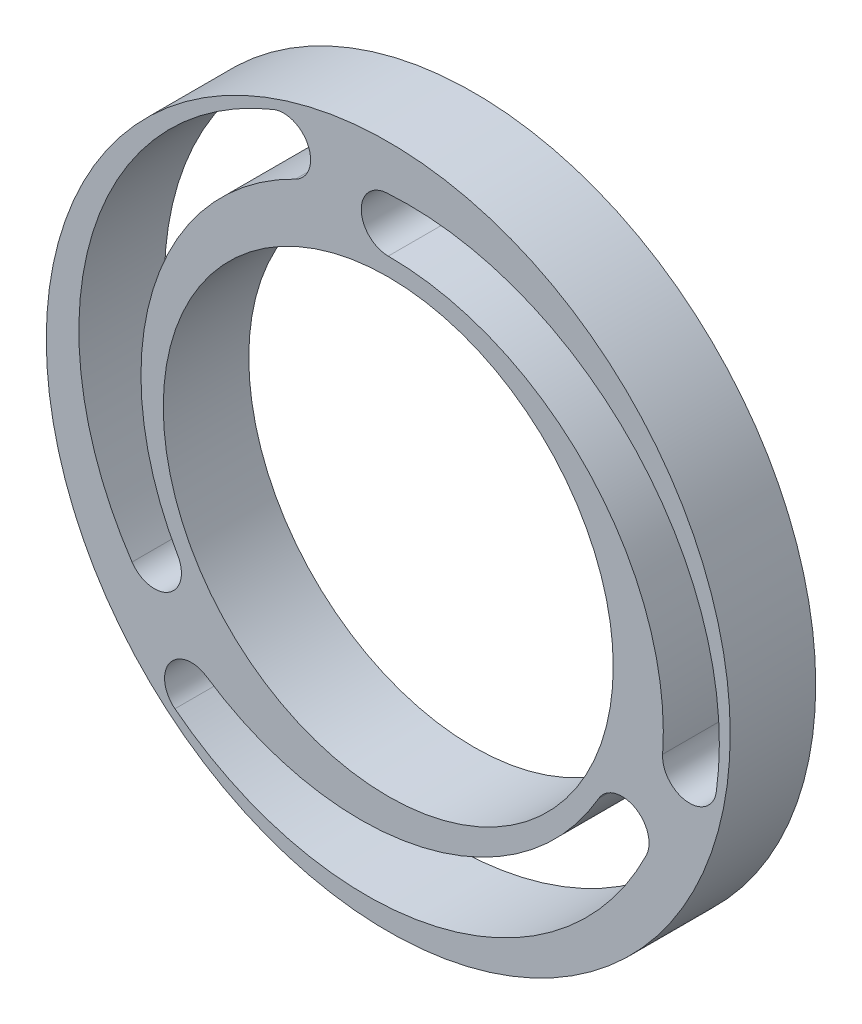
ISO-10303-21;
HEADER;
FILE_DESCRIPTION(('STEP AP214'),'2;1');
FILE_NAME('part.step','',(''),(''),'','','');
FILE_SCHEMA(('AUTOMOTIVE_DESIGN { 1 0 10303 214 1 1 1 1 }'));
ENDSEC;
DATA;
#1=APPLICATION_CONTEXT('core data for automotive mechanical design processes');
#2=APPLICATION_PROTOCOL_DEFINITION('international standard','automotive_design',2000,#1);
#3=PRODUCT_CONTEXT('',#1,'mechanical');
#4=PRODUCT('Part','Part','',(#3));
#5=PRODUCT_RELATED_PRODUCT_CATEGORY('part','',(#4));
#6=PRODUCT_DEFINITION_FORMATION('','',#4);
#7=PRODUCT_DEFINITION_CONTEXT('part definition',#1,'design');
#8=PRODUCT_DEFINITION('design','',#6,#7);
#9=PRODUCT_DEFINITION_SHAPE('','',#8);
#10=(LENGTH_UNIT() NAMED_UNIT(*) SI_UNIT(.MILLI.,.METRE.));
#11=(NAMED_UNIT(*) PLANE_ANGLE_UNIT() SI_UNIT($,.RADIAN.));
#12=(NAMED_UNIT(*) SI_UNIT($,.STERADIAN.) SOLID_ANGLE_UNIT());
#13=UNCERTAINTY_MEASURE_WITH_UNIT(LENGTH_MEASURE(1.E-05),#10,'distance_accuracy_value','');
#14=(GEOMETRIC_REPRESENTATION_CONTEXT(3) GLOBAL_UNCERTAINTY_ASSIGNED_CONTEXT((#13)) GLOBAL_UNIT_ASSIGNED_CONTEXT((#10,
#11,#12)) REPRESENTATION_CONTEXT('',''));
#15=CARTESIAN_POINT('',(0.,0.,0.));
#16=DIRECTION('',(0.,0.,1.));
#17=DIRECTION('',(1.,0.,0.));
#18=AXIS2_PLACEMENT_3D('',#15,#16,#17);
#19=CARTESIAN_POINT('',(0.,0.,9.5));
#20=DIRECTION('',(0.,0.,1.));
#21=DIRECTION('',(1.,0.,0.));
#22=AXIS2_PLACEMENT_3D('',#19,#20,#21);
#23=PLANE('',#22);
#24=CARTESIAN_POINT('',(-2.41247336985835,-1.14055669388795,9.5));
#25=DIRECTION('',(0.,0.,1.));
#26=DIRECTION('',(-0.500000000000004,-0.866025403784436,0.));
#27=AXIS2_PLACEMENT_3D('',#24,#25,#26);
#28=CIRCLE('',#27,34.5952526492614);
#29=CARTESIAN_POINT('',(28.6767274661686,-16.3159676353882,9.5));
#30=VERTEX_POINT('',#29);
#31=CARTESIAN_POINT('',(-23.70084455214,-28.4102607309989,9.5));
#32=VERTEX_POINT('',#31);
#33=EDGE_CURVE('E161',#30,#32,#28,.F.);
#34=ORIENTED_EDGE('',*,*,#33,.T.);
#35=CARTESIAN_POINT('',(-21.8547787293426,-26.0455110660451,9.5));
#36=DIRECTION('',(0.,0.,1.));
#37=DIRECTION('',(-0.500000000000004,-0.866025403784436,0.));
#38=AXIS2_PLACEMENT_3D('',#35,#36,#37);
#39=CIRCLE('',#38,3.);
#40=CARTESIAN_POINT('',(-20.1773783449244,-23.5582780752793,9.5));
#41=VERTEX_POINT('',#40);
#42=EDGE_CURVE('E168',#41,#32,#39,.T.);
#43=ORIENTED_EDGE('',*,*,#42,.F.);
#44=CARTESIAN_POINT('',(-3.08743132343008,1.78252930568686,9.5));
#45=DIRECTION('',(0.,0.,1.));
#46=DIRECTION('',(-0.500000000000004,-0.866025403784436,0.));
#47=AXIS2_PLACEMENT_3D('',#44,#45,#46);
#48=CIRCLE('',#47,30.5650586113737);
#49=CARTESIAN_POINT('',(23.3826859021798,-13.5000000000001,9.5));
#50=VERTEX_POINT('',#49);
#51=EDGE_CURVE('E55',#41,#50,#48,.T.);
#52=ORIENTED_EDGE('',*,*,#51,.T.);
#53=CARTESIAN_POINT('',(25.9807621135331,-15.0000000000001,9.5));
#54=DIRECTION('',(0.,0.,1.));
#55=DIRECTION('',(-0.500000000000004,-0.866025403784436,0.));
#56=AXIS2_PLACEMENT_3D('',#53,#54,#55);
#57=CIRCLE('',#56,3.);
#58=EDGE_CURVE('E164',#30,#50,#57,.T.);
#59=ORIENTED_EDGE('',*,*,#58,.F.);
#60=EDGE_LOOP('',(#34,#43,#52,#59));
#61=FACE_BOUND('',#60,.T.);
#62=CARTESIAN_POINT('',(0.,0.,9.5));
#63=DIRECTION('',(0.,0.,1.));
#64=DIRECTION('',(1.,0.,0.));
#65=AXIS2_PLACEMENT_3D('',#62,#63,#64);
#66=CIRCLE('',#65,25.);
#67=CARTESIAN_POINT('',(25.,0.,9.5));
#68=VERTEX_POINT('',#67);
#69=EDGE_CURVE('E219',#68,#68,#66,.T.);
#70=ORIENTED_EDGE('',*,*,#69,.F.);
#71=EDGE_LOOP('',(#70));
#72=FACE_BOUND('',#71,.T.);
#73=CARTESIAN_POINT('',(0.,0.,9.5));
#74=DIRECTION('',(0.,0.,1.));
#75=DIRECTION('',(1.,0.,0.));
#76=AXIS2_PLACEMENT_3D('',#73,#74,#75);
#77=CIRCLE('',#76,38.);
#78=CARTESIAN_POINT('',(38.,0.,9.5));
#79=VERTEX_POINT('',#78);
#80=EDGE_CURVE('E11',#79,#79,#77,.T.);
#81=ORIENTED_EDGE('',*,*,#80,.T.);
#82=EDGE_LOOP('',(#81));
#83=FACE_BOUND('',#82,.T.);
#84=CARTESIAN_POINT('',(2.19398775629254,-1.5189848773068,9.5));
#85=DIRECTION('',(0.,0.,1.));
#86=DIRECTION('',(1.,0.,0.));
#87=AXIS2_PLACEMENT_3D('',#84,#85,#86);
#88=CIRCLE('',#87,34.5952526492614);
#89=CARTESIAN_POINT('',(-0.208321273513586,32.9927583007991,9.5));
#90=VERTEX_POINT('',#89);
#91=CARTESIAN_POINT('',(36.4544297972545,-6.32040310779967,9.5));
#92=VERTEX_POINT('',#91);
#93=EDGE_CURVE('E189',#90,#92,#88,.F.);
#94=ORIENTED_EDGE('',*,*,#93,.T.);
#95=CARTESIAN_POINT('',(33.4834636024151,-5.90403804067576,9.5));
#96=DIRECTION('',(0.,0.,1.));
#97=DIRECTION('',(1.,0.,0.));
#98=AXIS2_PLACEMENT_3D('',#95,#96,#97);
#99=CIRCLE('',#98,3.);
#100=CARTESIAN_POINT('',(30.490756455072,-5.69498319083472,9.5));
#101=VERTEX_POINT('',#100);
#102=EDGE_CURVE('E198',#101,#92,#99,.T.);
#103=ORIENTED_EDGE('',*,*,#102,.F.);
#104=CARTESIAN_POINT('',(0.,-3.56505861137369,9.5));
#105=DIRECTION('',(0.,0.,1.));
#106=DIRECTION('',(1.,0.,0.));
#107=AXIS2_PLACEMENT_3D('',#104,#105,#106);
#108=CIRCLE('',#107,30.5650586113737);
#109=CARTESIAN_POINT('',(0.,27.,9.5));
#110=VERTEX_POINT('',#109);
#111=EDGE_CURVE('E195',#101,#110,#108,.T.);
#112=ORIENTED_EDGE('',*,*,#111,.T.);
#113=CARTESIAN_POINT('',(0.,30.,9.5));
#114=DIRECTION('',(0.,0.,1.));
#115=DIRECTION('',(1.,0.,0.));
#116=AXIS2_PLACEMENT_3D('',#113,#114,#115);
#117=CIRCLE('',#116,3.);
#118=EDGE_CURVE('E192',#90,#110,#117,.T.);
#119=ORIENTED_EDGE('',*,*,#118,.F.);
#120=EDGE_LOOP('',(#94,#103,#112,#119));
#121=FACE_BOUND('',#120,.T.);
#122=CARTESIAN_POINT('',(0.218485613565833,2.65954157119476,9.5));
#123=DIRECTION('',(0.,0.,1.));
#124=DIRECTION('',(-0.499999999999992,0.866025403784443,0.));
#125=AXIS2_PLACEMENT_3D('',#122,#123,#124);
#126=CIRCLE('',#125,34.5952526492614);
#127=CARTESIAN_POINT('',(-28.4684061926553,-16.6767906654108,9.5));
#128=VERTEX_POINT('',#127);
#129=CARTESIAN_POINT('',(-12.7535852451143,34.7306638387988,9.5));
#130=VERTEX_POINT('',#129);
#131=EDGE_CURVE('E136',#128,#130,#126,.F.);
#132=ORIENTED_EDGE('',*,*,#131,.T.);
#133=CARTESIAN_POINT('',(-11.6286848730723,31.949549106721,9.5));
#134=DIRECTION('',(0.,0.,1.));
#135=DIRECTION('',(-0.499999999999992,0.866025403784443,0.));
#136=AXIS2_PLACEMENT_3D('',#133,#134,#135);
#137=CIRCLE('',#136,3.);
#138=CARTESIAN_POINT('',(-10.3133781101475,29.2532612661142,9.5));
#139=VERTEX_POINT('',#138);
#140=EDGE_CURVE('E145',#139,#130,#137,.T.);
#141=ORIENTED_EDGE('',*,*,#140,.F.);
#142=CARTESIAN_POINT('',(3.08743132343011,1.78252930568682,9.5));
#143=DIRECTION('',(0.,0.,1.));
#144=DIRECTION('',(-0.499999999999992,0.866025403784443,0.));
#145=AXIS2_PLACEMENT_3D('',#142,#143,#144);
#146=CIRCLE('',#145,30.5650586113737);
#147=CARTESIAN_POINT('',(-23.38268590218,-13.4999999999998,9.5));
#148=VERTEX_POINT('',#147);
#149=EDGE_CURVE('E47',#139,#148,#146,.T.);
#150=ORIENTED_EDGE('',*,*,#149,.T.);
#151=CARTESIAN_POINT('',(-25.9807621135333,-14.9999999999998,9.5));
#152=DIRECTION('',(0.,0.,1.));
#153=DIRECTION('',(-0.499999999999992,0.866025403784443,0.));
#154=AXIS2_PLACEMENT_3D('',#151,#152,#153);
#155=CIRCLE('',#154,3.);
#156=EDGE_CURVE('E126',#128,#148,#155,.T.);
#157=ORIENTED_EDGE('',*,*,#156,.F.);
#158=EDGE_LOOP('',(#132,#141,#150,#157));
#159=FACE_BOUND('',#158,.T.);
#160=ADVANCED_FACE('F32',(#61,#72,#83,#121,#159),#23,.T.);
#161=CARTESIAN_POINT('',(0.,0.,0.));
#162=DIRECTION('',(0.,0.,1.));
#163=DIRECTION('',(1.,0.,0.));
#164=AXIS2_PLACEMENT_3D('',#161,#162,#163);
#165=PLANE('',#164);
#166=CARTESIAN_POINT('',(0.,0.,0.));
#167=DIRECTION('',(0.,0.,1.));
#168=DIRECTION('',(1.,0.,0.));
#169=AXIS2_PLACEMENT_3D('',#166,#167,#168);
#170=CIRCLE('',#169,38.);
#171=CARTESIAN_POINT('',(38.,0.,0.));
#172=VERTEX_POINT('',#171);
#173=EDGE_CURVE('E36',#172,#172,#170,.T.);
#174=ORIENTED_EDGE('',*,*,#173,.F.);
#175=EDGE_LOOP('',(#174));
#176=FACE_BOUND('',#175,.T.);
#177=CARTESIAN_POINT('',(0.,0.,0.));
#178=DIRECTION('',(0.,0.,1.));
#179=DIRECTION('',(1.,0.,0.));
#180=AXIS2_PLACEMENT_3D('',#177,#178,#179);
#181=CIRCLE('',#180,25.);
#182=CARTESIAN_POINT('',(25.,0.,0.));
#183=VERTEX_POINT('',#182);
#184=EDGE_CURVE('E218',#183,#183,#181,.T.);
#185=ORIENTED_EDGE('',*,*,#184,.T.);
#186=EDGE_LOOP('',(#185));
#187=FACE_BOUND('',#186,.T.);
#188=CARTESIAN_POINT('',(33.4834636024151,-5.90403804067576,0.));
#189=DIRECTION('',(0.,0.,1.));
#190=DIRECTION('',(1.,0.,0.));
#191=AXIS2_PLACEMENT_3D('',#188,#189,#190);
#192=CIRCLE('',#191,3.);
#193=CARTESIAN_POINT('',(30.490756455072,-5.69498319083472,0.));
#194=VERTEX_POINT('',#193);
#195=CARTESIAN_POINT('',(36.4544297972545,-6.32040310779967,0.));
#196=VERTEX_POINT('',#195);
#197=EDGE_CURVE('E193',#194,#196,#192,.T.);
#198=ORIENTED_EDGE('',*,*,#197,.T.);
#199=CARTESIAN_POINT('',(2.19398775629254,-1.5189848773068,0.));
#200=DIRECTION('',(0.,0.,1.));
#201=DIRECTION('',(1.,0.,0.));
#202=AXIS2_PLACEMENT_3D('',#199,#200,#201);
#203=CIRCLE('',#202,34.5952526492614);
#204=CARTESIAN_POINT('',(-0.208321273513586,32.9927583007991,0.));
#205=VERTEX_POINT('',#204);
#206=EDGE_CURVE('E188',#205,#196,#203,.F.);
#207=ORIENTED_EDGE('',*,*,#206,.F.);
#208=CARTESIAN_POINT('',(0.,30.,0.));
#209=DIRECTION('',(0.,0.,1.));
#210=DIRECTION('',(1.,0.,0.));
#211=AXIS2_PLACEMENT_3D('',#208,#209,#210);
#212=CIRCLE('',#211,3.);
#213=CARTESIAN_POINT('',(0.,27.,0.));
#214=VERTEX_POINT('',#213);
#215=EDGE_CURVE('E202',#205,#214,#212,.T.);
#216=ORIENTED_EDGE('',*,*,#215,.T.);
#217=CARTESIAN_POINT('',(0.,-3.56505861137369,0.));
#218=DIRECTION('',(0.,0.,1.));
#219=DIRECTION('',(1.,0.,0.));
#220=AXIS2_PLACEMENT_3D('',#217,#218,#219);
#221=CIRCLE('',#220,30.5650586113737);
#222=EDGE_CURVE('E205',#194,#214,#221,.T.);
#223=ORIENTED_EDGE('',*,*,#222,.F.);
#224=EDGE_LOOP('',(#198,#207,#216,#223));
#225=FACE_BOUND('',#224,.T.);
#226=CARTESIAN_POINT('',(-21.8547787293426,-26.0455110660451,0.));
#227=DIRECTION('',(0.,0.,1.));
#228=DIRECTION('',(-0.500000000000004,-0.866025403784436,0.));
#229=AXIS2_PLACEMENT_3D('',#226,#227,#228);
#230=CIRCLE('',#229,3.);
#231=CARTESIAN_POINT('',(-20.1773783449244,-23.5582780752793,0.));
#232=VERTEX_POINT('',#231);
#233=CARTESIAN_POINT('',(-23.70084455214,-28.4102607309989,0.));
#234=VERTEX_POINT('',#233);
#235=EDGE_CURVE('E165',#232,#234,#230,.T.);
#236=ORIENTED_EDGE('',*,*,#235,.T.);
#237=CARTESIAN_POINT('',(-2.41247336985835,-1.14055669388795,0.));
#238=DIRECTION('',(0.,0.,1.));
#239=DIRECTION('',(-0.500000000000004,-0.866025403784436,0.));
#240=AXIS2_PLACEMENT_3D('',#237,#238,#239);
#241=CIRCLE('',#240,34.5952526492614);
#242=CARTESIAN_POINT('',(28.6767274661686,-16.3159676353882,0.));
#243=VERTEX_POINT('',#242);
#244=EDGE_CURVE('E131',#243,#234,#241,.F.);
#245=ORIENTED_EDGE('',*,*,#244,.F.);
#246=CARTESIAN_POINT('',(25.9807621135331,-15.0000000000001,0.));
#247=DIRECTION('',(0.,0.,1.));
#248=DIRECTION('',(-0.500000000000004,-0.866025403784436,0.));
#249=AXIS2_PLACEMENT_3D('',#246,#247,#248);
#250=CIRCLE('',#249,3.);
#251=CARTESIAN_POINT('',(23.3826859021798,-13.5000000000001,0.));
#252=VERTEX_POINT('',#251);
#253=EDGE_CURVE('E172',#243,#252,#250,.T.);
#254=ORIENTED_EDGE('',*,*,#253,.T.);
#255=CARTESIAN_POINT('',(-3.08743132343008,1.78252930568686,0.));
#256=DIRECTION('',(0.,0.,1.));
#257=DIRECTION('',(-0.500000000000004,-0.866025403784436,0.));
#258=AXIS2_PLACEMENT_3D('',#255,#256,#257);
#259=CIRCLE('',#258,30.5650586113737);
#260=EDGE_CURVE('E175',#232,#252,#259,.T.);
#261=ORIENTED_EDGE('',*,*,#260,.F.);
#262=EDGE_LOOP('',(#236,#245,#254,#261));
#263=FACE_BOUND('',#262,.T.);
#264=CARTESIAN_POINT('',(-11.6286848730723,31.949549106721,0.));
#265=DIRECTION('',(0.,0.,1.));
#266=DIRECTION('',(-0.499999999999992,0.866025403784443,0.));
#267=AXIS2_PLACEMENT_3D('',#264,#265,#266);
#268=CIRCLE('',#267,3.);
#269=CARTESIAN_POINT('',(-10.3133781101475,29.2532612661142,0.));
#270=VERTEX_POINT('',#269);
#271=CARTESIAN_POINT('',(-12.7535852451143,34.7306638387988,0.));
#272=VERTEX_POINT('',#271);
#273=EDGE_CURVE('E142',#270,#272,#268,.T.);
#274=ORIENTED_EDGE('',*,*,#273,.T.);
#275=CARTESIAN_POINT('',(0.218485613565833,2.65954157119476,0.));
#276=DIRECTION('',(0.,0.,1.));
#277=DIRECTION('',(-0.499999999999992,0.866025403784443,0.));
#278=AXIS2_PLACEMENT_3D('',#275,#276,#277);
#279=CIRCLE('',#278,34.5952526492614);
#280=CARTESIAN_POINT('',(-28.4684061926553,-16.6767906654108,0.));
#281=VERTEX_POINT('',#280);
#282=EDGE_CURVE('E149',#281,#272,#279,.F.);
#283=ORIENTED_EDGE('',*,*,#282,.F.);
#284=CARTESIAN_POINT('',(-25.9807621135333,-14.9999999999998,0.));
#285=DIRECTION('',(0.,0.,1.));
#286=DIRECTION('',(-0.499999999999992,0.866025403784443,0.));
#287=AXIS2_PLACEMENT_3D('',#284,#285,#286);
#288=CIRCLE('',#287,3.);
#289=CARTESIAN_POINT('',(-23.38268590218,-13.4999999999998,0.));
#290=VERTEX_POINT('',#289);
#291=EDGE_CURVE('E128',#281,#290,#288,.T.);
#292=ORIENTED_EDGE('',*,*,#291,.T.);
#293=CARTESIAN_POINT('',(3.08743132343011,1.78252930568682,0.));
#294=DIRECTION('',(0.,0.,1.));
#295=DIRECTION('',(-0.499999999999992,0.866025403784443,0.));
#296=AXIS2_PLACEMENT_3D('',#293,#294,#295);
#297=CIRCLE('',#296,30.5650586113737);
#298=EDGE_CURVE('E152',#270,#290,#297,.T.);
#299=ORIENTED_EDGE('',*,*,#298,.F.);
#300=EDGE_LOOP('',(#274,#283,#292,#299));
#301=FACE_BOUND('',#300,.T.);
#302=ADVANCED_FACE('F225',(#176,#187,#225,#263,#301),#165,.F.);
#303=CARTESIAN_POINT('',(0.,0.,9.5));
#304=DIRECTION('',(0.,0.,-1.));
#305=DIRECTION('',(-1.,0.,0.));
#306=AXIS2_PLACEMENT_3D('',#303,#304,#305);
#307=CYLINDRICAL_SURFACE('',#306,38.);
#308=ORIENTED_EDGE('',*,*,#80,.F.);
#309=EDGE_LOOP('',(#308));
#310=FACE_BOUND('',#309,.T.);
#311=ORIENTED_EDGE('',*,*,#173,.T.);
#312=EDGE_LOOP('',(#311));
#313=FACE_BOUND('',#312,.T.);
#314=ADVANCED_FACE('F34',(#310,#313),#307,.T.);
#315=CARTESIAN_POINT('',(0.,0.,9.5));
#316=DIRECTION('',(0.,0.,-1.));
#317=DIRECTION('',(-1.,0.,0.));
#318=AXIS2_PLACEMENT_3D('',#315,#316,#317);
#319=CYLINDRICAL_SURFACE('',#318,25.);
#320=ORIENTED_EDGE('',*,*,#69,.T.);
#321=EDGE_LOOP('',(#320));
#322=FACE_BOUND('',#321,.T.);
#323=ORIENTED_EDGE('',*,*,#184,.F.);
#324=EDGE_LOOP('',(#323));
#325=FACE_BOUND('',#324,.T.);
#326=ADVANCED_FACE('F228',(#322,#325),#319,.F.);
#327=CARTESIAN_POINT('',(2.19398775629254,-1.5189848773068,9.5));
#328=DIRECTION('',(0.,0.,-1.));
#329=DIRECTION('',(-1.,0.,0.));
#330=AXIS2_PLACEMENT_3D('',#327,#328,#329);
#331=CYLINDRICAL_SURFACE('',#330,34.5952526492614);
#332=ORIENTED_EDGE('',*,*,#206,.T.);
#333=DIRECTION('',(0.,0.,-1.));
#334=VECTOR('',#333,1.);
#335=CARTESIAN_POINT('',(36.4544297972545,-6.32040310779967,9.5));
#336=LINE('',#335,#334);
#337=EDGE_CURVE('E200',#92,#196,#336,.T.);
#338=ORIENTED_EDGE('',*,*,#337,.F.);
#339=ORIENTED_EDGE('',*,*,#93,.F.);
#340=DIRECTION('',(0.,0.,-1.));
#341=VECTOR('',#340,1.);
#342=CARTESIAN_POINT('',(-0.208321273513586,32.9927583007991,9.5));
#343=LINE('',#342,#341);
#344=EDGE_CURVE('E216',#90,#205,#343,.T.);
#345=ORIENTED_EDGE('',*,*,#344,.T.);
#346=EDGE_LOOP('',(#332,#338,#339,#345));
#347=FACE_BOUND('',#346,.T.);
#348=ADVANCED_FACE('F230',(#347),#331,.F.);
#349=CARTESIAN_POINT('',(0.,30.,9.5));
#350=DIRECTION('',(0.,0.,-1.));
#351=DIRECTION('',(-1.,0.,0.));
#352=AXIS2_PLACEMENT_3D('',#349,#350,#351);
#353=CYLINDRICAL_SURFACE('',#352,3.);
#354=ORIENTED_EDGE('',*,*,#215,.F.);
#355=ORIENTED_EDGE('',*,*,#344,.F.);
#356=ORIENTED_EDGE('',*,*,#118,.T.);
#357=DIRECTION('',(0.,0.,-1.));
#358=VECTOR('',#357,1.);
#359=CARTESIAN_POINT('',(0.,27.,9.5));
#360=LINE('',#359,#358);
#361=EDGE_CURVE('E214',#110,#214,#360,.T.);
#362=ORIENTED_EDGE('',*,*,#361,.T.);
#363=EDGE_LOOP('',(#354,#355,#356,#362));
#364=FACE_BOUND('',#363,.T.);
#365=ADVANCED_FACE('F237',(#364),#353,.F.);
#366=CARTESIAN_POINT('',(0.,-3.56505861137369,9.5));
#367=DIRECTION('',(0.,0.,-1.));
#368=DIRECTION('',(-1.,0.,0.));
#369=AXIS2_PLACEMENT_3D('',#366,#367,#368);
#370=CYLINDRICAL_SURFACE('',#369,30.5650586113737);
#371=ORIENTED_EDGE('',*,*,#222,.T.);
#372=ORIENTED_EDGE('',*,*,#361,.F.);
#373=ORIENTED_EDGE('',*,*,#111,.F.);
#374=DIRECTION('',(0.,0.,-1.));
#375=VECTOR('',#374,1.);
#376=CARTESIAN_POINT('',(30.490756455072,-5.69498319083472,9.5));
#377=LINE('',#376,#375);
#378=EDGE_CURVE('E212',#101,#194,#377,.T.);
#379=ORIENTED_EDGE('',*,*,#378,.T.);
#380=EDGE_LOOP('',(#371,#372,#373,#379));
#381=FACE_BOUND('',#380,.T.);
#382=ADVANCED_FACE('F270',(#381),#370,.T.);
#383=CARTESIAN_POINT('',(33.4834636024151,-5.90403804067576,9.5));
#384=DIRECTION('',(0.,0.,-1.));
#385=DIRECTION('',(-1.,0.,0.));
#386=AXIS2_PLACEMENT_3D('',#383,#384,#385);
#387=CYLINDRICAL_SURFACE('',#386,3.);
#388=ORIENTED_EDGE('',*,*,#197,.F.);
#389=ORIENTED_EDGE('',*,*,#378,.F.);
#390=ORIENTED_EDGE('',*,*,#102,.T.);
#391=ORIENTED_EDGE('',*,*,#337,.T.);
#392=EDGE_LOOP('',(#388,#389,#390,#391));
#393=FACE_BOUND('',#392,.T.);
#394=ADVANCED_FACE('F264',(#393),#387,.F.);
#395=CARTESIAN_POINT('',(-2.41247336985835,-1.14055669388795,9.5));
#396=DIRECTION('',(0.,0.,-1.));
#397=DIRECTION('',(-1.,0.,0.));
#398=AXIS2_PLACEMENT_3D('',#395,#396,#397);
#399=CYLINDRICAL_SURFACE('',#398,34.5952526492614);
#400=ORIENTED_EDGE('',*,*,#244,.T.);
#401=DIRECTION('',(0.,0.,-1.));
#402=VECTOR('',#401,1.);
#403=CARTESIAN_POINT('',(-23.70084455214,-28.4102607309989,9.5));
#404=LINE('',#403,#402);
#405=EDGE_CURVE('E170',#32,#234,#404,.T.);
#406=ORIENTED_EDGE('',*,*,#405,.F.);
#407=ORIENTED_EDGE('',*,*,#33,.F.);
#408=DIRECTION('',(0.,0.,-1.));
#409=VECTOR('',#408,1.);
#410=CARTESIAN_POINT('',(28.6767274661686,-16.3159676353882,9.5));
#411=LINE('',#410,#409);
#412=EDGE_CURVE('E186',#30,#243,#411,.T.);
#413=ORIENTED_EDGE('',*,*,#412,.T.);
#414=EDGE_LOOP('',(#400,#406,#407,#413));
#415=FACE_BOUND('',#414,.T.);
#416=ADVANCED_FACE('F281',(#415),#399,.F.);
#417=CARTESIAN_POINT('',(25.9807621135331,-15.0000000000001,9.5));
#418=DIRECTION('',(0.,0.,-1.));
#419=DIRECTION('',(-1.,0.,0.));
#420=AXIS2_PLACEMENT_3D('',#417,#418,#419);
#421=CYLINDRICAL_SURFACE('',#420,3.);
#422=ORIENTED_EDGE('',*,*,#253,.F.);
#423=ORIENTED_EDGE('',*,*,#412,.F.);
#424=ORIENTED_EDGE('',*,*,#58,.T.);
#425=DIRECTION('',(0.,0.,-1.));
#426=VECTOR('',#425,1.);
#427=CARTESIAN_POINT('',(23.3826859021798,-13.5000000000001,9.5));
#428=LINE('',#427,#426);
#429=EDGE_CURVE('E184',#50,#252,#428,.T.);
#430=ORIENTED_EDGE('',*,*,#429,.T.);
#431=EDGE_LOOP('',(#422,#423,#424,#430));
#432=FACE_BOUND('',#431,.T.);
#433=ADVANCED_FACE('F284',(#432),#421,.F.);
#434=CARTESIAN_POINT('',(-3.08743132343008,1.78252930568686,9.5));
#435=DIRECTION('',(0.,0.,-1.));
#436=DIRECTION('',(-1.,0.,0.));
#437=AXIS2_PLACEMENT_3D('',#434,#435,#436);
#438=CYLINDRICAL_SURFACE('',#437,30.5650586113737);
#439=ORIENTED_EDGE('',*,*,#260,.T.);
#440=ORIENTED_EDGE('',*,*,#429,.F.);
#441=ORIENTED_EDGE('',*,*,#51,.F.);
#442=DIRECTION('',(0.,0.,-1.));
#443=VECTOR('',#442,1.);
#444=CARTESIAN_POINT('',(-20.1773783449244,-23.5582780752793,9.5));
#445=LINE('',#444,#443);
#446=EDGE_CURVE('E182',#41,#232,#445,.T.);
#447=ORIENTED_EDGE('',*,*,#446,.T.);
#448=EDGE_LOOP('',(#439,#440,#441,#447));
#449=FACE_BOUND('',#448,.T.);
#450=ADVANCED_FACE('F288',(#449),#438,.T.);
#451=CARTESIAN_POINT('',(-21.8547787293426,-26.0455110660451,9.5));
#452=DIRECTION('',(0.,0.,-1.));
#453=DIRECTION('',(-1.,0.,0.));
#454=AXIS2_PLACEMENT_3D('',#451,#452,#453);
#455=CYLINDRICAL_SURFACE('',#454,3.);
#456=ORIENTED_EDGE('',*,*,#235,.F.);
#457=ORIENTED_EDGE('',*,*,#446,.F.);
#458=ORIENTED_EDGE('',*,*,#42,.T.);
#459=ORIENTED_EDGE('',*,*,#405,.T.);
#460=EDGE_LOOP('',(#456,#457,#458,#459));
#461=FACE_BOUND('',#460,.T.);
#462=ADVANCED_FACE('F292',(#461),#455,.F.);
#463=CARTESIAN_POINT('',(0.218485613565833,2.65954157119476,9.5));
#464=DIRECTION('',(0.,0.,-1.));
#465=DIRECTION('',(-1.,0.,0.));
#466=AXIS2_PLACEMENT_3D('',#463,#464,#465);
#467=CYLINDRICAL_SURFACE('',#466,34.5952526492614);
#468=ORIENTED_EDGE('',*,*,#282,.T.);
#469=DIRECTION('',(0.,0.,-1.));
#470=VECTOR('',#469,1.);
#471=CARTESIAN_POINT('',(-12.7535852451143,34.7306638387988,9.5));
#472=LINE('',#471,#470);
#473=EDGE_CURVE('E139',#130,#272,#472,.T.);
#474=ORIENTED_EDGE('',*,*,#473,.F.);
#475=ORIENTED_EDGE('',*,*,#131,.F.);
#476=DIRECTION('',(0.,0.,-1.));
#477=VECTOR('',#476,1.);
#478=CARTESIAN_POINT('',(-28.4684061926553,-16.6767906654108,9.5));
#479=LINE('',#478,#477);
#480=EDGE_CURVE('E122',#128,#281,#479,.T.);
#481=ORIENTED_EDGE('',*,*,#480,.T.);
#482=EDGE_LOOP('',(#468,#474,#475,#481));
#483=FACE_BOUND('',#482,.T.);
#484=ADVANCED_FACE('F137',(#483),#467,.F.);
#485=CARTESIAN_POINT('',(-25.9807621135333,-14.9999999999998,9.5));
#486=DIRECTION('',(0.,0.,-1.));
#487=DIRECTION('',(-1.,0.,0.));
#488=AXIS2_PLACEMENT_3D('',#485,#486,#487);
#489=CYLINDRICAL_SURFACE('',#488,3.);
#490=ORIENTED_EDGE('',*,*,#291,.F.);
#491=ORIENTED_EDGE('',*,*,#480,.F.);
#492=ORIENTED_EDGE('',*,*,#156,.T.);
#493=DIRECTION('',(0.,0.,-1.));
#494=VECTOR('',#493,1.);
#495=CARTESIAN_POINT('',(-23.38268590218,-13.4999999999998,9.5));
#496=LINE('',#495,#494);
#497=EDGE_CURVE('E132',#148,#290,#496,.T.);
#498=ORIENTED_EDGE('',*,*,#497,.T.);
#499=EDGE_LOOP('',(#490,#491,#492,#498));
#500=FACE_BOUND('',#499,.T.);
#501=ADVANCED_FACE('F124',(#500),#489,.F.);
#502=CARTESIAN_POINT('',(3.08743132343011,1.78252930568682,9.5));
#503=DIRECTION('',(0.,0.,-1.));
#504=DIRECTION('',(-1.,0.,0.));
#505=AXIS2_PLACEMENT_3D('',#502,#503,#504);
#506=CYLINDRICAL_SURFACE('',#505,30.5650586113737);
#507=ORIENTED_EDGE('',*,*,#298,.T.);
#508=ORIENTED_EDGE('',*,*,#497,.F.);
#509=ORIENTED_EDGE('',*,*,#149,.F.);
#510=DIRECTION('',(0.,0.,-1.));
#511=VECTOR('',#510,1.);
#512=CARTESIAN_POINT('',(-10.3133781101475,29.2532612661142,9.5));
#513=LINE('',#512,#511);
#514=EDGE_CURVE('E158',#139,#270,#513,.T.);
#515=ORIENTED_EDGE('',*,*,#514,.T.);
#516=EDGE_LOOP('',(#507,#508,#509,#515));
#517=FACE_BOUND('',#516,.T.);
#518=ADVANCED_FACE('F300',(#517),#506,.T.);
#519=CARTESIAN_POINT('',(-11.6286848730723,31.949549106721,9.5));
#520=DIRECTION('',(0.,0.,-1.));
#521=DIRECTION('',(-1.,0.,0.));
#522=AXIS2_PLACEMENT_3D('',#519,#520,#521);
#523=CYLINDRICAL_SURFACE('',#522,3.);
#524=ORIENTED_EDGE('',*,*,#273,.F.);
#525=ORIENTED_EDGE('',*,*,#514,.F.);
#526=ORIENTED_EDGE('',*,*,#140,.T.);
#527=ORIENTED_EDGE('',*,*,#473,.T.);
#528=EDGE_LOOP('',(#524,#525,#526,#527));
#529=FACE_BOUND('',#528,.T.);
#530=ADVANCED_FACE('F303',(#529),#523,.F.);
#531=CLOSED_SHELL('',(#160,#302,#314,#326,#348,#365,#382,#394,#416,#433,#450,#462,#484,#501,
#518,#530));
#532=MANIFOLD_SOLID_BREP('B2',#531);
#533=ADVANCED_BREP_SHAPE_REPRESENTATION('',(#18,#532),#14);
#534=SHAPE_DEFINITION_REPRESENTATION(#9,#533);
ENDSEC;
END-ISO-10303-21;
